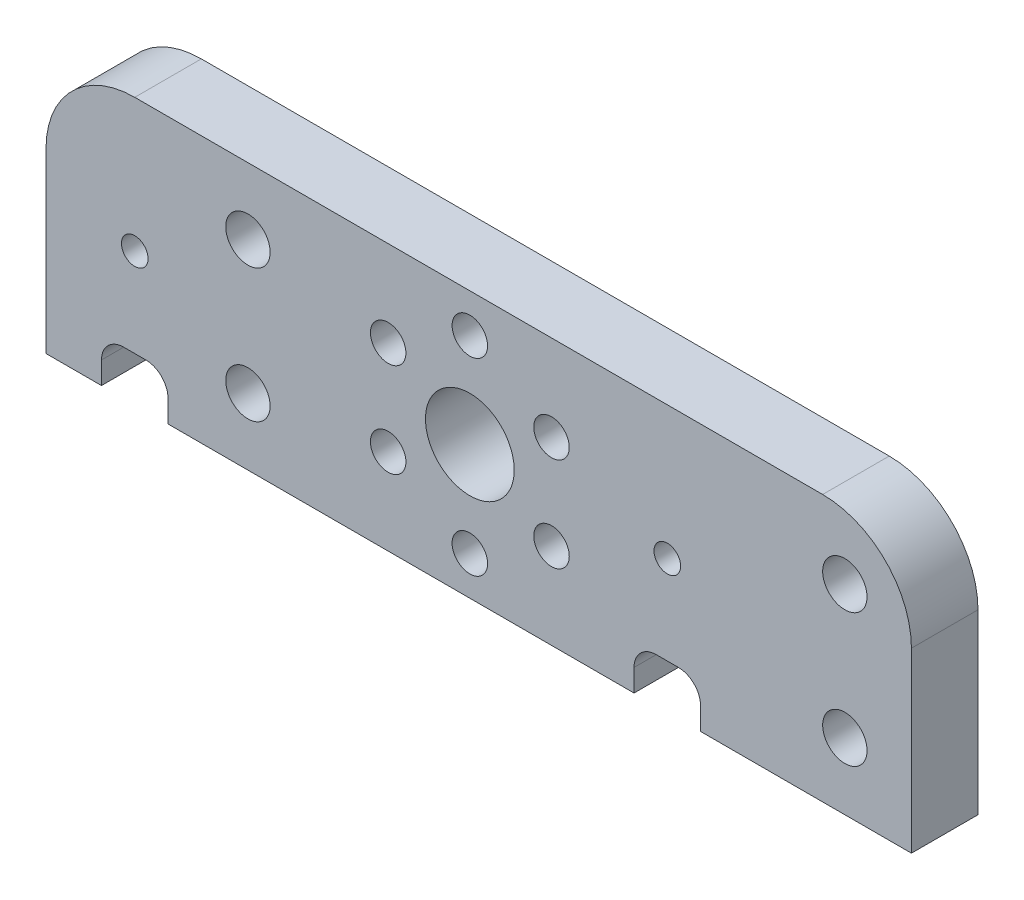
ISO-10303-21;
HEADER;
FILE_DESCRIPTION(('STEP AP214'),'2;1');
FILE_NAME('part.step','',(''),(''),'','','');
FILE_SCHEMA(('AUTOMOTIVE_DESIGN { 1 0 10303 214 1 1 1 1 }'));
ENDSEC;
DATA;
#1=APPLICATION_CONTEXT('core data for automotive mechanical design processes');
#2=APPLICATION_PROTOCOL_DEFINITION('international standard','automotive_design',2000,#1);
#3=PRODUCT_CONTEXT('',#1,'mechanical');
#4=PRODUCT('Part','Part','',(#3));
#5=PRODUCT_RELATED_PRODUCT_CATEGORY('part','',(#4));
#6=PRODUCT_DEFINITION_FORMATION('','',#4);
#7=PRODUCT_DEFINITION_CONTEXT('part definition',#1,'design');
#8=PRODUCT_DEFINITION('design','',#6,#7);
#9=PRODUCT_DEFINITION_SHAPE('','',#8);
#10=(LENGTH_UNIT() NAMED_UNIT(*) SI_UNIT(.MILLI.,.METRE.));
#11=(NAMED_UNIT(*) PLANE_ANGLE_UNIT() SI_UNIT($,.RADIAN.));
#12=(NAMED_UNIT(*) SI_UNIT($,.STERADIAN.) SOLID_ANGLE_UNIT());
#13=UNCERTAINTY_MEASURE_WITH_UNIT(LENGTH_MEASURE(1.E-05),#10,'distance_accuracy_value','');
#14=(GEOMETRIC_REPRESENTATION_CONTEXT(3) GLOBAL_UNCERTAINTY_ASSIGNED_CONTEXT((#13)) GLOBAL_UNIT_ASSIGNED_CONTEXT((#10,
#11,#12)) REPRESENTATION_CONTEXT('',''));
#15=CARTESIAN_POINT('',(0.,0.,0.));
#16=DIRECTION('',(0.,0.,1.));
#17=DIRECTION('',(1.,0.,0.));
#18=AXIS2_PLACEMENT_3D('',#15,#16,#17);
#19=CARTESIAN_POINT('',(-20.6,0.,3.));
#20=DIRECTION('',(-1.,0.,0.));
#21=DIRECTION('',(0.,0.,1.));
#22=AXIS2_PLACEMENT_3D('',#19,#20,#21);
#23=PLANE('',#22);
#24=DIRECTION('',(0.,1.,0.));
#25=VECTOR('',#24,1.);
#26=CARTESIAN_POINT('',(-20.6,0.,0.));
#27=LINE('',#26,#25);
#28=CARTESIAN_POINT('',(-20.6,-6.,0.));
#29=VERTEX_POINT('',#28);
#30=CARTESIAN_POINT('',(-20.6,-5.,0.));
#31=VERTEX_POINT('',#30);
#32=EDGE_CURVE('E215',#29,#31,#27,.T.);
#33=ORIENTED_EDGE('',*,*,#32,.T.);
#34=DIRECTION('',(0.,0.,-1.));
#35=VECTOR('',#34,1.);
#36=CARTESIAN_POINT('',(-20.6,-5.,3.));
#37=LINE('',#36,#35);
#38=CARTESIAN_POINT('',(-20.6,-5.,3.));
#39=VERTEX_POINT('',#38);
#40=EDGE_CURVE('E11',#39,#31,#37,.T.);
#41=ORIENTED_EDGE('',*,*,#40,.F.);
#42=DIRECTION('',(0.,1.,0.));
#43=VECTOR('',#42,1.);
#44=CARTESIAN_POINT('',(-20.6,0.,3.));
#45=LINE('',#44,#43);
#46=CARTESIAN_POINT('',(-20.6,-6.,3.));
#47=VERTEX_POINT('',#46);
#48=EDGE_CURVE('E668',#47,#39,#45,.T.);
#49=ORIENTED_EDGE('',*,*,#48,.F.);
#50=DIRECTION('',(0.,0.,-1.));
#51=VECTOR('',#50,1.);
#52=CARTESIAN_POINT('',(-20.6,-6.,3.));
#53=LINE('',#52,#51);
#54=EDGE_CURVE('E187',#47,#29,#53,.T.);
#55=ORIENTED_EDGE('',*,*,#54,.T.);
#56=EDGE_LOOP('',(#33,#41,#49,#55));
#57=FACE_BOUND('',#56,.T.);
#58=ADVANCED_FACE('F35',(#57),#23,.F.);
#59=CARTESIAN_POINT('',(-19.6,-5.,3.));
#60=DIRECTION('',(0.,0.,-1.));
#61=DIRECTION('',(-1.,0.,0.));
#62=AXIS2_PLACEMENT_3D('',#59,#60,#61);
#63=CYLINDRICAL_SURFACE('',#62,1.);
#64=CARTESIAN_POINT('',(-19.6,-5.,0.));
#65=DIRECTION('',(0.,0.,1.));
#66=DIRECTION('',(1.,0.,0.));
#67=AXIS2_PLACEMENT_3D('',#64,#65,#66);
#68=CIRCLE('',#67,1.);
#69=CARTESIAN_POINT('',(-19.6,-4.,0.));
#70=VERTEX_POINT('',#69);
#71=EDGE_CURVE('E218',#31,#70,#68,.F.);
#72=ORIENTED_EDGE('',*,*,#71,.T.);
#73=DIRECTION('',(0.,0.,-1.));
#74=VECTOR('',#73,1.);
#75=CARTESIAN_POINT('',(-19.6,-4.,3.));
#76=LINE('',#75,#74);
#77=CARTESIAN_POINT('',(-19.6,-4.,3.));
#78=VERTEX_POINT('',#77);
#79=EDGE_CURVE('E44',#78,#70,#76,.T.);
#80=ORIENTED_EDGE('',*,*,#79,.F.);
#81=CARTESIAN_POINT('',(-19.6,-5.,3.));
#82=DIRECTION('',(0.,0.,1.));
#83=DIRECTION('',(1.,0.,0.));
#84=AXIS2_PLACEMENT_3D('',#81,#82,#83);
#85=CIRCLE('',#84,1.);
#86=EDGE_CURVE('E121',#39,#78,#85,.F.);
#87=ORIENTED_EDGE('',*,*,#86,.F.);
#88=ORIENTED_EDGE('',*,*,#40,.T.);
#89=EDGE_LOOP('',(#72,#80,#87,#88));
#90=FACE_BOUND('',#89,.T.);
#91=ADVANCED_FACE('F389',(#90),#63,.F.);
#92=CARTESIAN_POINT('',(0.,-4.,3.));
#93=DIRECTION('',(0.,1.,0.));
#94=DIRECTION('',(0.,0.,1.));
#95=AXIS2_PLACEMENT_3D('',#92,#93,#94);
#96=PLANE('',#95);
#97=DIRECTION('',(1.,0.,0.));
#98=VECTOR('',#97,1.);
#99=CARTESIAN_POINT('',(0.,-4.,0.));
#100=LINE('',#99,#98);
#101=CARTESIAN_POINT('',(-18.6,-4.,0.));
#102=VERTEX_POINT('',#101);
#103=EDGE_CURVE('E220',#70,#102,#100,.T.);
#104=ORIENTED_EDGE('',*,*,#103,.T.);
#105=DIRECTION('',(0.,0.,-1.));
#106=VECTOR('',#105,1.);
#107=CARTESIAN_POINT('',(-18.6,-4.,3.));
#108=LINE('',#107,#106);
#109=CARTESIAN_POINT('',(-18.6,-4.,3.));
#110=VERTEX_POINT('',#109);
#111=EDGE_CURVE('E285',#110,#102,#108,.T.);
#112=ORIENTED_EDGE('',*,*,#111,.F.);
#113=DIRECTION('',(1.,0.,0.));
#114=VECTOR('',#113,1.);
#115=CARTESIAN_POINT('',(0.,-4.,3.));
#116=LINE('',#115,#114);
#117=EDGE_CURVE('E293',#78,#110,#116,.T.);
#118=ORIENTED_EDGE('',*,*,#117,.F.);
#119=ORIENTED_EDGE('',*,*,#79,.T.);
#120=EDGE_LOOP('',(#104,#112,#118,#119));
#121=FACE_BOUND('',#120,.T.);
#122=ADVANCED_FACE('F291',(#121),#96,.F.);
#123=CARTESIAN_POINT('',(-18.6,-5.,3.));
#124=DIRECTION('',(0.,0.,-1.));
#125=DIRECTION('',(-1.,0.,0.));
#126=AXIS2_PLACEMENT_3D('',#123,#124,#125);
#127=CYLINDRICAL_SURFACE('',#126,1.);
#128=CARTESIAN_POINT('',(-18.6,-5.,0.));
#129=DIRECTION('',(0.,0.,1.));
#130=DIRECTION('',(1.,0.,0.));
#131=AXIS2_PLACEMENT_3D('',#128,#129,#130);
#132=CIRCLE('',#131,1.);
#133=CARTESIAN_POINT('',(-17.6,-5.,0.));
#134=VERTEX_POINT('',#133);
#135=EDGE_CURVE('E222',#102,#134,#132,.F.);
#136=ORIENTED_EDGE('',*,*,#135,.T.);
#137=DIRECTION('',(0.,0.,-1.));
#138=VECTOR('',#137,1.);
#139=CARTESIAN_POINT('',(-17.6,-5.,3.));
#140=LINE('',#139,#138);
#141=CARTESIAN_POINT('',(-17.6,-5.,3.));
#142=VERTEX_POINT('',#141);
#143=EDGE_CURVE('E283',#142,#134,#140,.T.);
#144=ORIENTED_EDGE('',*,*,#143,.F.);
#145=CARTESIAN_POINT('',(-18.6,-5.,3.));
#146=DIRECTION('',(0.,0.,1.));
#147=DIRECTION('',(1.,0.,0.));
#148=AXIS2_PLACEMENT_3D('',#145,#146,#147);
#149=CIRCLE('',#148,1.);
#150=EDGE_CURVE('E305',#110,#142,#149,.F.);
#151=ORIENTED_EDGE('',*,*,#150,.F.);
#152=ORIENTED_EDGE('',*,*,#111,.T.);
#153=EDGE_LOOP('',(#136,#144,#151,#152));
#154=FACE_BOUND('',#153,.T.);
#155=ADVANCED_FACE('F302',(#154),#127,.F.);
#156=CARTESIAN_POINT('',(-17.6,0.,3.));
#157=DIRECTION('',(-1.,0.,0.));
#158=DIRECTION('',(0.,0.,1.));
#159=AXIS2_PLACEMENT_3D('',#156,#157,#158);
#160=PLANE('',#159);
#161=DIRECTION('',(0.,1.,0.));
#162=VECTOR('',#161,1.);
#163=CARTESIAN_POINT('',(-17.6,0.,0.));
#164=LINE('',#163,#162);
#165=CARTESIAN_POINT('',(-17.6,-6.,0.));
#166=VERTEX_POINT('',#165);
#167=EDGE_CURVE('E225',#166,#134,#164,.T.);
#168=ORIENTED_EDGE('',*,*,#167,.F.);
#169=DIRECTION('',(0.,0.,-1.));
#170=VECTOR('',#169,1.);
#171=CARTESIAN_POINT('',(-17.6,-6.,3.));
#172=LINE('',#171,#170);
#173=CARTESIAN_POINT('',(-17.6,-6.,3.));
#174=VERTEX_POINT('',#173);
#175=EDGE_CURVE('E281',#174,#166,#172,.T.);
#176=ORIENTED_EDGE('',*,*,#175,.F.);
#177=DIRECTION('',(0.,1.,0.));
#178=VECTOR('',#177,1.);
#179=CARTESIAN_POINT('',(-17.6,0.,3.));
#180=LINE('',#179,#178);
#181=EDGE_CURVE('E307',#174,#142,#180,.T.);
#182=ORIENTED_EDGE('',*,*,#181,.T.);
#183=ORIENTED_EDGE('',*,*,#143,.T.);
#184=EDGE_LOOP('',(#168,#176,#182,#183));
#185=FACE_BOUND('',#184,.T.);
#186=ADVANCED_FACE('F377',(#185),#160,.T.);
#187=CARTESIAN_POINT('',(0.,-6.,3.));
#188=DIRECTION('',(0.,1.,0.));
#189=DIRECTION('',(0.,0.,1.));
#190=AXIS2_PLACEMENT_3D('',#187,#188,#189);
#191=PLANE('',#190);
#192=DIRECTION('',(1.,0.,0.));
#193=VECTOR('',#192,1.);
#194=CARTESIAN_POINT('',(0.,-6.,0.));
#195=LINE('',#194,#193);
#196=CARTESIAN_POINT('',(3.4,-6.,0.));
#197=VERTEX_POINT('',#196);
#198=EDGE_CURVE('E228',#166,#197,#195,.T.);
#199=ORIENTED_EDGE('',*,*,#198,.T.);
#200=DIRECTION('',(0.,0.,-1.));
#201=VECTOR('',#200,1.);
#202=CARTESIAN_POINT('',(3.4,-6.,3.));
#203=LINE('',#202,#201);
#204=CARTESIAN_POINT('',(3.4,-6.,3.));
#205=VERTEX_POINT('',#204);
#206=EDGE_CURVE('E278',#205,#197,#203,.T.);
#207=ORIENTED_EDGE('',*,*,#206,.F.);
#208=DIRECTION('',(1.,0.,0.));
#209=VECTOR('',#208,1.);
#210=CARTESIAN_POINT('',(0.,-6.,3.));
#211=LINE('',#210,#209);
#212=EDGE_CURVE('E190',#174,#205,#211,.T.);
#213=ORIENTED_EDGE('',*,*,#212,.F.);
#214=ORIENTED_EDGE('',*,*,#175,.T.);
#215=EDGE_LOOP('',(#199,#207,#213,#214));
#216=FACE_BOUND('',#215,.T.);
#217=ADVANCED_FACE('F375',(#216),#191,.F.);
#218=CARTESIAN_POINT('',(3.4,0.,3.));
#219=DIRECTION('',(-1.,0.,0.));
#220=DIRECTION('',(0.,-1.,0.));
#221=AXIS2_PLACEMENT_3D('',#218,#219,#220);
#222=PLANE('',#221);
#223=DIRECTION('',(0.,1.,0.));
#224=VECTOR('',#223,1.);
#225=CARTESIAN_POINT('',(3.4,0.,0.));
#226=LINE('',#225,#224);
#227=CARTESIAN_POINT('',(3.4,-5.,0.));
#228=VERTEX_POINT('',#227);
#229=EDGE_CURVE('E230',#197,#228,#226,.T.);
#230=ORIENTED_EDGE('',*,*,#229,.T.);
#231=DIRECTION('',(0.,0.,-1.));
#232=VECTOR('',#231,1.);
#233=CARTESIAN_POINT('',(3.4,-5.,3.));
#234=LINE('',#233,#232);
#235=CARTESIAN_POINT('',(3.4,-5.,3.));
#236=VERTEX_POINT('',#235);
#237=EDGE_CURVE('E275',#236,#228,#234,.T.);
#238=ORIENTED_EDGE('',*,*,#237,.F.);
#239=DIRECTION('',(0.,1.,0.));
#240=VECTOR('',#239,1.);
#241=CARTESIAN_POINT('',(3.4,0.,3.));
#242=LINE('',#241,#240);
#243=EDGE_CURVE('E313',#205,#236,#242,.T.);
#244=ORIENTED_EDGE('',*,*,#243,.F.);
#245=ORIENTED_EDGE('',*,*,#206,.T.);
#246=EDGE_LOOP('',(#230,#238,#244,#245));
#247=FACE_BOUND('',#246,.T.);
#248=ADVANCED_FACE('F370',(#247),#222,.F.);
#249=CARTESIAN_POINT('',(4.4,-5.,3.));
#250=DIRECTION('',(0.,0.,-1.));
#251=DIRECTION('',(-1.,0.,0.));
#252=AXIS2_PLACEMENT_3D('',#249,#250,#251);
#253=CYLINDRICAL_SURFACE('',#252,0.999999999999999);
#254=CARTESIAN_POINT('',(4.4,-5.,0.));
#255=DIRECTION('',(0.,0.,1.));
#256=DIRECTION('',(1.,0.,0.));
#257=AXIS2_PLACEMENT_3D('',#254,#255,#256);
#258=CIRCLE('',#257,0.999999999999999);
#259=CARTESIAN_POINT('',(4.4,-4.,0.));
#260=VERTEX_POINT('',#259);
#261=EDGE_CURVE('E233',#228,#260,#258,.F.);
#262=ORIENTED_EDGE('',*,*,#261,.T.);
#263=DIRECTION('',(0.,0.,-1.));
#264=VECTOR('',#263,1.);
#265=CARTESIAN_POINT('',(4.4,-4.,3.));
#266=LINE('',#265,#264);
#267=CARTESIAN_POINT('',(4.4,-4.,3.));
#268=VERTEX_POINT('',#267);
#269=EDGE_CURVE('E272',#268,#260,#266,.T.);
#270=ORIENTED_EDGE('',*,*,#269,.F.);
#271=CARTESIAN_POINT('',(4.4,-5.,3.));
#272=DIRECTION('',(0.,0.,1.));
#273=DIRECTION('',(1.,0.,0.));
#274=AXIS2_PLACEMENT_3D('',#271,#272,#273);
#275=CIRCLE('',#274,0.999999999999999);
#276=EDGE_CURVE('E315',#236,#268,#275,.F.);
#277=ORIENTED_EDGE('',*,*,#276,.F.);
#278=ORIENTED_EDGE('',*,*,#237,.T.);
#279=EDGE_LOOP('',(#262,#270,#277,#278));
#280=FACE_BOUND('',#279,.T.);
#281=ADVANCED_FACE('F366',(#280),#253,.F.);
#282=CARTESIAN_POINT('',(0.,-4.,3.));
#283=DIRECTION('',(0.,1.,0.));
#284=DIRECTION('',(0.,0.,1.));
#285=AXIS2_PLACEMENT_3D('',#282,#283,#284);
#286=PLANE('',#285);
#287=DIRECTION('',(1.,0.,0.));
#288=VECTOR('',#287,1.);
#289=CARTESIAN_POINT('',(0.,-4.,0.));
#290=LINE('',#289,#288);
#291=CARTESIAN_POINT('',(5.4,-4.,0.));
#292=VERTEX_POINT('',#291);
#293=EDGE_CURVE('E235',#260,#292,#290,.T.);
#294=ORIENTED_EDGE('',*,*,#293,.T.);
#295=DIRECTION('',(0.,0.,-1.));
#296=VECTOR('',#295,1.);
#297=CARTESIAN_POINT('',(5.4,-4.,3.));
#298=LINE('',#297,#296);
#299=CARTESIAN_POINT('',(5.4,-4.,3.));
#300=VERTEX_POINT('',#299);
#301=EDGE_CURVE('E269',#300,#292,#298,.T.);
#302=ORIENTED_EDGE('',*,*,#301,.F.);
#303=DIRECTION('',(1.,0.,0.));
#304=VECTOR('',#303,1.);
#305=CARTESIAN_POINT('',(0.,-4.,3.));
#306=LINE('',#305,#304);
#307=EDGE_CURVE('E317',#268,#300,#306,.T.);
#308=ORIENTED_EDGE('',*,*,#307,.F.);
#309=ORIENTED_EDGE('',*,*,#269,.T.);
#310=EDGE_LOOP('',(#294,#302,#308,#309));
#311=FACE_BOUND('',#310,.T.);
#312=ADVANCED_FACE('F362',(#311),#286,.F.);
#313=CARTESIAN_POINT('',(5.4,-5.,3.));
#314=DIRECTION('',(0.,0.,-1.));
#315=DIRECTION('',(-1.,0.,0.));
#316=AXIS2_PLACEMENT_3D('',#313,#314,#315);
#317=CYLINDRICAL_SURFACE('',#316,0.999999999999999);
#318=CARTESIAN_POINT('',(5.4,-5.,0.));
#319=DIRECTION('',(0.,0.,1.));
#320=DIRECTION('',(1.,0.,0.));
#321=AXIS2_PLACEMENT_3D('',#318,#319,#320);
#322=CIRCLE('',#321,0.999999999999999);
#323=CARTESIAN_POINT('',(6.4,-5.,0.));
#324=VERTEX_POINT('',#323);
#325=EDGE_CURVE('E237',#292,#324,#322,.F.);
#326=ORIENTED_EDGE('',*,*,#325,.T.);
#327=DIRECTION('',(0.,0.,-1.));
#328=VECTOR('',#327,1.);
#329=CARTESIAN_POINT('',(6.4,-5.,3.));
#330=LINE('',#329,#328);
#331=CARTESIAN_POINT('',(6.4,-5.,3.));
#332=VERTEX_POINT('',#331);
#333=EDGE_CURVE('E267',#332,#324,#330,.T.);
#334=ORIENTED_EDGE('',*,*,#333,.F.);
#335=CARTESIAN_POINT('',(5.4,-5.,3.));
#336=DIRECTION('',(0.,0.,1.));
#337=DIRECTION('',(1.,0.,0.));
#338=AXIS2_PLACEMENT_3D('',#335,#336,#337);
#339=CIRCLE('',#338,0.999999999999999);
#340=EDGE_CURVE('E319',#300,#332,#339,.F.);
#341=ORIENTED_EDGE('',*,*,#340,.F.);
#342=ORIENTED_EDGE('',*,*,#301,.T.);
#343=EDGE_LOOP('',(#326,#334,#341,#342));
#344=FACE_BOUND('',#343,.T.);
#345=ADVANCED_FACE('F358',(#344),#317,.F.);
#346=CARTESIAN_POINT('',(6.4,0.,3.));
#347=DIRECTION('',(-1.,0.,0.));
#348=DIRECTION('',(0.,0.,1.));
#349=AXIS2_PLACEMENT_3D('',#346,#347,#348);
#350=PLANE('',#349);
#351=DIRECTION('',(0.,1.,0.));
#352=VECTOR('',#351,1.);
#353=CARTESIAN_POINT('',(6.4,0.,0.));
#354=LINE('',#353,#352);
#355=CARTESIAN_POINT('',(6.4,-6.,0.));
#356=VERTEX_POINT('',#355);
#357=EDGE_CURVE('E240',#356,#324,#354,.T.);
#358=ORIENTED_EDGE('',*,*,#357,.F.);
#359=DIRECTION('',(0.,0.,-1.));
#360=VECTOR('',#359,1.);
#361=CARTESIAN_POINT('',(6.4,-6.,3.));
#362=LINE('',#361,#360);
#363=CARTESIAN_POINT('',(6.4,-6.,3.));
#364=VERTEX_POINT('',#363);
#365=EDGE_CURVE('E265',#364,#356,#362,.T.);
#366=ORIENTED_EDGE('',*,*,#365,.F.);
#367=DIRECTION('',(0.,1.,0.));
#368=VECTOR('',#367,1.);
#369=CARTESIAN_POINT('',(6.4,0.,3.));
#370=LINE('',#369,#368);
#371=EDGE_CURVE('E321',#364,#332,#370,.T.);
#372=ORIENTED_EDGE('',*,*,#371,.T.);
#373=ORIENTED_EDGE('',*,*,#333,.T.);
#374=EDGE_LOOP('',(#358,#366,#372,#373));
#375=FACE_BOUND('',#374,.T.);
#376=ADVANCED_FACE('F353',(#375),#350,.T.);
#377=CARTESIAN_POINT('',(15.9,-6.,0.));
#378=VERTEX_POINT('',#377);
#379=EDGE_CURVE('E231',#356,#378,#195,.T.);
#380=ORIENTED_EDGE('',*,*,#379,.T.);
#381=DIRECTION('',(0.,0.,-1.));
#382=VECTOR('',#381,1.);
#383=CARTESIAN_POINT('',(15.9,-6.,3.));
#384=LINE('',#383,#382);
#385=CARTESIAN_POINT('',(15.9,-6.,3.));
#386=VERTEX_POINT('',#385);
#387=EDGE_CURVE('E262',#386,#378,#384,.T.);
#388=ORIENTED_EDGE('',*,*,#387,.F.);
#389=EDGE_CURVE('E189',#364,#386,#211,.T.);
#390=ORIENTED_EDGE('',*,*,#389,.F.);
#391=ORIENTED_EDGE('',*,*,#365,.T.);
#392=EDGE_LOOP('',(#380,#388,#390,#391));
#393=FACE_BOUND('',#392,.T.);
#394=ADVANCED_FACE('F339',(#393),#191,.F.);
#395=CARTESIAN_POINT('',(15.9,0.,3.));
#396=DIRECTION('',(-1.,0.,0.));
#397=DIRECTION('',(0.,-1.,0.));
#398=AXIS2_PLACEMENT_3D('',#395,#396,#397);
#399=PLANE('',#398);
#400=DIRECTION('',(0.,1.,0.));
#401=VECTOR('',#400,1.);
#402=CARTESIAN_POINT('',(15.9,0.,0.));
#403=LINE('',#402,#401);
#404=CARTESIAN_POINT('',(15.9,2.,0.));
#405=VERTEX_POINT('',#404);
#406=EDGE_CURVE('E243',#378,#405,#403,.T.);
#407=ORIENTED_EDGE('',*,*,#406,.T.);
#408=DIRECTION('',(0.,0.,-1.));
#409=VECTOR('',#408,1.);
#410=CARTESIAN_POINT('',(15.9,2.,3.));
#411=LINE('',#410,#409);
#412=CARTESIAN_POINT('',(15.9,2.,3.));
#413=VERTEX_POINT('',#412);
#414=EDGE_CURVE('E260',#413,#405,#411,.T.);
#415=ORIENTED_EDGE('',*,*,#414,.F.);
#416=DIRECTION('',(0.,1.,0.));
#417=VECTOR('',#416,1.);
#418=CARTESIAN_POINT('',(15.9,0.,3.));
#419=LINE('',#418,#417);
#420=EDGE_CURVE('E324',#386,#413,#419,.T.);
#421=ORIENTED_EDGE('',*,*,#420,.F.);
#422=ORIENTED_EDGE('',*,*,#387,.T.);
#423=EDGE_LOOP('',(#407,#415,#421,#422));
#424=FACE_BOUND('',#423,.T.);
#425=ADVANCED_FACE('F345',(#424),#399,.F.);
#426=CARTESIAN_POINT('',(11.9,2.,3.));
#427=DIRECTION('',(0.,0.,-1.));
#428=DIRECTION('',(-1.,0.,0.));
#429=AXIS2_PLACEMENT_3D('',#426,#427,#428);
#430=CYLINDRICAL_SURFACE('',#429,4.);
#431=CARTESIAN_POINT('',(11.9,2.,0.));
#432=DIRECTION('',(0.,0.,1.));
#433=DIRECTION('',(1.,0.,0.));
#434=AXIS2_PLACEMENT_3D('',#431,#432,#433);
#435=CIRCLE('',#434,4.);
#436=CARTESIAN_POINT('',(11.9,6.,0.));
#437=VERTEX_POINT('',#436);
#438=EDGE_CURVE('E246',#437,#405,#435,.F.);
#439=ORIENTED_EDGE('',*,*,#438,.F.);
#440=DIRECTION('',(0.,0.,-1.));
#441=VECTOR('',#440,1.);
#442=CARTESIAN_POINT('',(11.9,6.,3.));
#443=LINE('',#442,#441);
#444=CARTESIAN_POINT('',(11.9,6.,3.));
#445=VERTEX_POINT('',#444);
#446=EDGE_CURVE('E258',#445,#437,#443,.T.);
#447=ORIENTED_EDGE('',*,*,#446,.F.);
#448=CARTESIAN_POINT('',(11.9,2.,3.));
#449=DIRECTION('',(0.,0.,1.));
#450=DIRECTION('',(1.,0.,0.));
#451=AXIS2_PLACEMENT_3D('',#448,#449,#450);
#452=CIRCLE('',#451,4.);
#453=EDGE_CURVE('E326',#445,#413,#452,.F.);
#454=ORIENTED_EDGE('',*,*,#453,.T.);
#455=ORIENTED_EDGE('',*,*,#414,.T.);
#456=EDGE_LOOP('',(#439,#447,#454,#455));
#457=FACE_BOUND('',#456,.T.);
#458=ADVANCED_FACE('F348',(#457),#430,.T.);
#459=CARTESIAN_POINT('',(0.,6.,3.));
#460=DIRECTION('',(0.,1.,0.));
#461=DIRECTION('',(0.,0.,1.));
#462=AXIS2_PLACEMENT_3D('',#459,#460,#461);
#463=PLANE('',#462);
#464=DIRECTION('',(1.,0.,0.));
#465=VECTOR('',#464,1.);
#466=CARTESIAN_POINT('',(0.,6.,0.));
#467=LINE('',#466,#465);
#468=CARTESIAN_POINT('',(-19.1,6.,0.));
#469=VERTEX_POINT('',#468);
#470=EDGE_CURVE('E249',#469,#437,#467,.T.);
#471=ORIENTED_EDGE('',*,*,#470,.F.);
#472=DIRECTION('',(0.,0.,-1.));
#473=VECTOR('',#472,1.);
#474=CARTESIAN_POINT('',(-19.1,6.,3.));
#475=LINE('',#474,#473);
#476=CARTESIAN_POINT('',(-19.1,6.,3.));
#477=VERTEX_POINT('',#476);
#478=EDGE_CURVE('E176',#477,#469,#475,.T.);
#479=ORIENTED_EDGE('',*,*,#478,.F.);
#480=DIRECTION('',(1.,0.,0.));
#481=VECTOR('',#480,1.);
#482=CARTESIAN_POINT('',(0.,6.,3.));
#483=LINE('',#482,#481);
#484=EDGE_CURVE('E183',#477,#445,#483,.T.);
#485=ORIENTED_EDGE('',*,*,#484,.T.);
#486=ORIENTED_EDGE('',*,*,#446,.T.);
#487=EDGE_LOOP('',(#471,#479,#485,#486));
#488=FACE_BOUND('',#487,.T.);
#489=ADVANCED_FACE('F330',(#488),#463,.T.);
#490=CARTESIAN_POINT('',(-19.1,2.,3.));
#491=DIRECTION('',(0.,0.,-1.));
#492=DIRECTION('',(-1.,0.,0.));
#493=AXIS2_PLACEMENT_3D('',#490,#491,#492);
#494=CYLINDRICAL_SURFACE('',#493,4.);
#495=CARTESIAN_POINT('',(-19.1,2.,0.));
#496=DIRECTION('',(0.,0.,1.));
#497=DIRECTION('',(1.,0.,0.));
#498=AXIS2_PLACEMENT_3D('',#495,#496,#497);
#499=CIRCLE('',#498,4.);
#500=CARTESIAN_POINT('',(-23.1,2.,0.));
#501=VERTEX_POINT('',#500);
#502=EDGE_CURVE('E171',#501,#469,#499,.F.);
#503=ORIENTED_EDGE('',*,*,#502,.F.);
#504=DIRECTION('',(0.,0.,-1.));
#505=VECTOR('',#504,1.);
#506=CARTESIAN_POINT('',(-23.1,2.,3.));
#507=LINE('',#506,#505);
#508=CARTESIAN_POINT('',(-23.1,2.,3.));
#509=VERTEX_POINT('',#508);
#510=EDGE_CURVE('E166',#509,#501,#507,.T.);
#511=ORIENTED_EDGE('',*,*,#510,.F.);
#512=CARTESIAN_POINT('',(-19.1,2.,3.));
#513=DIRECTION('',(0.,0.,1.));
#514=DIRECTION('',(1.,0.,0.));
#515=AXIS2_PLACEMENT_3D('',#512,#513,#514);
#516=CIRCLE('',#515,4.);
#517=EDGE_CURVE('E169',#509,#477,#516,.F.);
#518=ORIENTED_EDGE('',*,*,#517,.T.);
#519=ORIENTED_EDGE('',*,*,#478,.T.);
#520=EDGE_LOOP('',(#503,#511,#518,#519));
#521=FACE_BOUND('',#520,.T.);
#522=ADVANCED_FACE('F168',(#521),#494,.T.);
#523=CARTESIAN_POINT('',(-23.1,0.,3.));
#524=DIRECTION('',(-1.,0.,0.));
#525=DIRECTION('',(0.,0.,1.));
#526=AXIS2_PLACEMENT_3D('',#523,#524,#525);
#527=PLANE('',#526);
#528=DIRECTION('',(0.,1.,0.));
#529=VECTOR('',#528,1.);
#530=CARTESIAN_POINT('',(-23.1,0.,0.));
#531=LINE('',#530,#529);
#532=CARTESIAN_POINT('',(-23.1,-6.,0.));
#533=VERTEX_POINT('',#532);
#534=EDGE_CURVE('E253',#533,#501,#531,.T.);
#535=ORIENTED_EDGE('',*,*,#534,.F.);
#536=DIRECTION('',(0.,0.,-1.));
#537=VECTOR('',#536,1.);
#538=CARTESIAN_POINT('',(-23.1,-6.,3.));
#539=LINE('',#538,#537);
#540=CARTESIAN_POINT('',(-23.1,-6.,3.));
#541=VERTEX_POINT('',#540);
#542=EDGE_CURVE('E110',#541,#533,#539,.T.);
#543=ORIENTED_EDGE('',*,*,#542,.F.);
#544=DIRECTION('',(0.,1.,0.));
#545=VECTOR('',#544,1.);
#546=CARTESIAN_POINT('',(-23.1,0.,3.));
#547=LINE('',#546,#545);
#548=EDGE_CURVE('E180',#541,#509,#547,.T.);
#549=ORIENTED_EDGE('',*,*,#548,.T.);
#550=ORIENTED_EDGE('',*,*,#510,.T.);
#551=EDGE_LOOP('',(#535,#543,#549,#550));
#552=FACE_BOUND('',#551,.T.);
#553=ADVANCED_FACE('F185',(#552),#527,.T.);
#554=CARTESIAN_POINT('',(-4.,0.,3.));
#555=DIRECTION('',(0.,0.,-1.));
#556=DIRECTION('',(-1.,0.,0.));
#557=AXIS2_PLACEMENT_3D('',#554,#555,#556);
#558=CYLINDRICAL_SURFACE('',#557,2.);
#559=CARTESIAN_POINT('',(-4.,0.,3.));
#560=DIRECTION('',(0.,0.,1.));
#561=DIRECTION('',(1.,0.,0.));
#562=AXIS2_PLACEMENT_3D('',#559,#560,#561);
#563=CIRCLE('',#562,2.);
#564=CARTESIAN_POINT('',(-2.,0.,3.));
#565=VERTEX_POINT('',#564);
#566=EDGE_CURVE('E665',#565,#565,#563,.T.);
#567=ORIENTED_EDGE('',*,*,#566,.T.);
#568=EDGE_LOOP('',(#567));
#569=FACE_BOUND('',#568,.T.);
#570=CARTESIAN_POINT('',(-4.,0.,0.));
#571=DIRECTION('',(0.,0.,1.));
#572=DIRECTION('',(1.,0.,0.));
#573=AXIS2_PLACEMENT_3D('',#570,#571,#572);
#574=CIRCLE('',#573,2.);
#575=CARTESIAN_POINT('',(-2.,0.,0.));
#576=VERTEX_POINT('',#575);
#577=EDGE_CURVE('E212',#576,#576,#574,.T.);
#578=ORIENTED_EDGE('',*,*,#577,.F.);
#579=EDGE_LOOP('',(#578));
#580=FACE_BOUND('',#579,.T.);
#581=ADVANCED_FACE('F398',(#569,#580),#558,.F.);
#582=CARTESIAN_POINT('',(4.9,0.,3.));
#583=DIRECTION('',(0.,0.,-1.));
#584=DIRECTION('',(-1.,0.,0.));
#585=AXIS2_PLACEMENT_3D('',#582,#583,#584);
#586=CYLINDRICAL_SURFACE('',#585,0.6);
#587=CARTESIAN_POINT('',(4.9,0.,3.));
#588=DIRECTION('',(0.,0.,1.));
#589=DIRECTION('',(1.,0.,0.));
#590=AXIS2_PLACEMENT_3D('',#587,#588,#589);
#591=CIRCLE('',#590,0.6);
#592=CARTESIAN_POINT('',(5.5,0.,3.));
#593=VERTEX_POINT('',#592);
#594=EDGE_CURVE('E662',#593,#593,#591,.T.);
#595=ORIENTED_EDGE('',*,*,#594,.T.);
#596=EDGE_LOOP('',(#595));
#597=FACE_BOUND('',#596,.T.);
#598=CARTESIAN_POINT('',(4.9,0.,0.));
#599=DIRECTION('',(0.,0.,1.));
#600=DIRECTION('',(1.,0.,0.));
#601=AXIS2_PLACEMENT_3D('',#598,#599,#600);
#602=CIRCLE('',#601,0.6);
#603=CARTESIAN_POINT('',(5.5,0.,0.));
#604=VERTEX_POINT('',#603);
#605=EDGE_CURVE('E209',#604,#604,#602,.T.);
#606=ORIENTED_EDGE('',*,*,#605,.F.);
#607=EDGE_LOOP('',(#606));
#608=FACE_BOUND('',#607,.T.);
#609=ADVANCED_FACE('F401',(#597,#608),#586,.F.);
#610=CARTESIAN_POINT('',(-19.1,0.,3.));
#611=DIRECTION('',(0.,0.,-1.));
#612=DIRECTION('',(-1.,0.,0.));
#613=AXIS2_PLACEMENT_3D('',#610,#611,#612);
#614=CYLINDRICAL_SURFACE('',#613,0.6);
#615=CARTESIAN_POINT('',(-19.1,0.,3.));
#616=DIRECTION('',(0.,0.,1.));
#617=DIRECTION('',(1.,0.,0.));
#618=AXIS2_PLACEMENT_3D('',#615,#616,#617);
#619=CIRCLE('',#618,0.6);
#620=CARTESIAN_POINT('',(-18.5,0.,3.));
#621=VERTEX_POINT('',#620);
#622=EDGE_CURVE('E659',#621,#621,#619,.T.);
#623=ORIENTED_EDGE('',*,*,#622,.T.);
#624=EDGE_LOOP('',(#623));
#625=FACE_BOUND('',#624,.T.);
#626=CARTESIAN_POINT('',(-19.1,0.,0.));
#627=DIRECTION('',(0.,0.,1.));
#628=DIRECTION('',(1.,0.,0.));
#629=AXIS2_PLACEMENT_3D('',#626,#627,#628);
#630=CIRCLE('',#629,0.6);
#631=CARTESIAN_POINT('',(-18.5,0.,0.));
#632=VERTEX_POINT('',#631);
#633=EDGE_CURVE('E206',#632,#632,#630,.T.);
#634=ORIENTED_EDGE('',*,*,#633,.F.);
#635=EDGE_LOOP('',(#634));
#636=FACE_BOUND('',#635,.T.);
#637=ADVANCED_FACE('F405',(#625,#636),#614,.F.);
#638=CARTESIAN_POINT('',(12.9,3.,3.));
#639=DIRECTION('',(0.,0.,-1.));
#640=DIRECTION('',(-1.,0.,0.));
#641=AXIS2_PLACEMENT_3D('',#638,#639,#640);
#642=CYLINDRICAL_SURFACE('',#641,1.);
#643=CARTESIAN_POINT('',(12.9,3.,3.));
#644=DIRECTION('',(0.,0.,1.));
#645=DIRECTION('',(1.,0.,0.));
#646=AXIS2_PLACEMENT_3D('',#643,#644,#645);
#647=CIRCLE('',#646,1.);
#648=CARTESIAN_POINT('',(13.9,3.,3.));
#649=VERTEX_POINT('',#648);
#650=EDGE_CURVE('E656',#649,#649,#647,.T.);
#651=ORIENTED_EDGE('',*,*,#650,.T.);
#652=EDGE_LOOP('',(#651));
#653=FACE_BOUND('',#652,.T.);
#654=CARTESIAN_POINT('',(12.9,3.,0.));
#655=DIRECTION('',(0.,0.,1.));
#656=DIRECTION('',(1.,0.,0.));
#657=AXIS2_PLACEMENT_3D('',#654,#655,#656);
#658=CIRCLE('',#657,1.);
#659=CARTESIAN_POINT('',(13.9,3.,0.));
#660=VERTEX_POINT('',#659);
#661=EDGE_CURVE('E203',#660,#660,#658,.T.);
#662=ORIENTED_EDGE('',*,*,#661,.F.);
#663=EDGE_LOOP('',(#662));
#664=FACE_BOUND('',#663,.T.);
#665=ADVANCED_FACE('F409',(#653,#664),#642,.F.);
#666=CARTESIAN_POINT('',(12.9,-3.,3.));
#667=DIRECTION('',(0.,0.,-1.));
#668=DIRECTION('',(-1.,0.,0.));
#669=AXIS2_PLACEMENT_3D('',#666,#667,#668);
#670=CYLINDRICAL_SURFACE('',#669,1.);
#671=CARTESIAN_POINT('',(12.9,-3.,3.));
#672=DIRECTION('',(0.,0.,1.));
#673=DIRECTION('',(1.,0.,0.));
#674=AXIS2_PLACEMENT_3D('',#671,#672,#673);
#675=CIRCLE('',#674,1.);
#676=CARTESIAN_POINT('',(13.9,-3.,3.));
#677=VERTEX_POINT('',#676);
#678=EDGE_CURVE('E653',#677,#677,#675,.T.);
#679=ORIENTED_EDGE('',*,*,#678,.T.);
#680=EDGE_LOOP('',(#679));
#681=FACE_BOUND('',#680,.T.);
#682=CARTESIAN_POINT('',(12.9,-3.,0.));
#683=DIRECTION('',(0.,0.,1.));
#684=DIRECTION('',(1.,0.,0.));
#685=AXIS2_PLACEMENT_3D('',#682,#683,#684);
#686=CIRCLE('',#685,1.);
#687=CARTESIAN_POINT('',(13.9,-3.,0.));
#688=VERTEX_POINT('',#687);
#689=EDGE_CURVE('E200',#688,#688,#686,.T.);
#690=ORIENTED_EDGE('',*,*,#689,.F.);
#691=EDGE_LOOP('',(#690));
#692=FACE_BOUND('',#691,.T.);
#693=ADVANCED_FACE('F413',(#681,#692),#670,.F.);
#694=CARTESIAN_POINT('',(-14.,-3.,3.));
#695=DIRECTION('',(0.,0.,-1.));
#696=DIRECTION('',(-1.,0.,0.));
#697=AXIS2_PLACEMENT_3D('',#694,#695,#696);
#698=CYLINDRICAL_SURFACE('',#697,1.);
#699=CARTESIAN_POINT('',(-14.,-3.,3.));
#700=DIRECTION('',(0.,0.,1.));
#701=DIRECTION('',(1.,0.,0.));
#702=AXIS2_PLACEMENT_3D('',#699,#700,#701);
#703=CIRCLE('',#702,1.);
#704=CARTESIAN_POINT('',(-13.,-3.,3.));
#705=VERTEX_POINT('',#704);
#706=EDGE_CURVE('E334',#705,#705,#703,.T.);
#707=ORIENTED_EDGE('',*,*,#706,.T.);
#708=EDGE_LOOP('',(#707));
#709=FACE_BOUND('',#708,.T.);
#710=CARTESIAN_POINT('',(-14.,-3.,0.));
#711=DIRECTION('',(0.,0.,1.));
#712=DIRECTION('',(1.,0.,0.));
#713=AXIS2_PLACEMENT_3D('',#710,#711,#712);
#714=CIRCLE('',#713,1.);
#715=CARTESIAN_POINT('',(-13.,-3.,0.));
#716=VERTEX_POINT('',#715);
#717=EDGE_CURVE('E196',#716,#716,#714,.T.);
#718=ORIENTED_EDGE('',*,*,#717,.F.);
#719=EDGE_LOOP('',(#718));
#720=FACE_BOUND('',#719,.T.);
#721=ADVANCED_FACE('F416',(#709,#720),#698,.F.);
#722=CARTESIAN_POINT('',(-14.,3.,3.));
#723=DIRECTION('',(0.,0.,-1.));
#724=DIRECTION('',(-1.,0.,0.));
#725=AXIS2_PLACEMENT_3D('',#722,#723,#724);
#726=CYLINDRICAL_SURFACE('',#725,1.);
#727=CARTESIAN_POINT('',(-14.,3.,3.));
#728=DIRECTION('',(0.,0.,1.));
#729=DIRECTION('',(1.,0.,0.));
#730=AXIS2_PLACEMENT_3D('',#727,#728,#729);
#731=CIRCLE('',#730,1.);
#732=CARTESIAN_POINT('',(-13.,3.,3.));
#733=VERTEX_POINT('',#732);
#734=EDGE_CURVE('E332',#733,#733,#731,.T.);
#735=ORIENTED_EDGE('',*,*,#734,.T.);
#736=EDGE_LOOP('',(#735));
#737=FACE_BOUND('',#736,.T.);
#738=CARTESIAN_POINT('',(-14.,3.,0.));
#739=DIRECTION('',(0.,0.,1.));
#740=DIRECTION('',(1.,0.,0.));
#741=AXIS2_PLACEMENT_3D('',#738,#739,#740);
#742=CIRCLE('',#741,1.);
#743=CARTESIAN_POINT('',(-13.,3.,0.));
#744=VERTEX_POINT('',#743);
#745=EDGE_CURVE('E193',#744,#744,#742,.T.);
#746=ORIENTED_EDGE('',*,*,#745,.F.);
#747=EDGE_LOOP('',(#746));
#748=FACE_BOUND('',#747,.T.);
#749=ADVANCED_FACE('F37',(#737,#748),#726,.F.);
#750=EDGE_CURVE('E113',#533,#29,#195,.T.);
#751=ORIENTED_EDGE('',*,*,#750,.T.);
#752=ORIENTED_EDGE('',*,*,#54,.F.);
#753=EDGE_CURVE('E52',#541,#47,#211,.T.);
#754=ORIENTED_EDGE('',*,*,#753,.F.);
#755=ORIENTED_EDGE('',*,*,#542,.T.);
#756=EDGE_LOOP('',(#751,#752,#754,#755));
#757=FACE_BOUND('',#756,.T.);
#758=ADVANCED_FACE('F385',(#757),#191,.F.);
#759=CARTESIAN_POINT('',(0.,0.,3.));
#760=DIRECTION('',(0.,0.,1.));
#761=DIRECTION('',(1.,0.,0.));
#762=AXIS2_PLACEMENT_3D('',#759,#760,#761);
#763=PLANE('',#762);
#764=CARTESIAN_POINT('',(-0.31939203391616,2.12500000000004,3.));
#765=DIRECTION('',(0.,0.,1.));
#766=DIRECTION('',(0.50000000000001,-0.866025403784433,0.));
#767=AXIS2_PLACEMENT_3D('',#764,#765,#766);
#768=CIRCLE('',#767,0.8);
#769=CARTESIAN_POINT('',(0.0806079660838479,1.4321796769725,3.));
#770=VERTEX_POINT('',#769);
#771=EDGE_CURVE('E634',#770,#770,#768,.T.);
#772=ORIENTED_EDGE('',*,*,#771,.F.);
#773=EDGE_LOOP('',(#772));
#774=FACE_BOUND('',#773,.T.);
#775=CARTESIAN_POINT('',(-0.319392033916116,-2.12499999999997,3.));
#776=DIRECTION('',(0.,0.,1.));
#777=DIRECTION('',(-0.499999999999992,-0.866025403784443,0.));
#778=AXIS2_PLACEMENT_3D('',#775,#776,#777);
#779=CIRCLE('',#778,0.8);
#780=CARTESIAN_POINT('',(-0.719392033916109,-2.81782032302752,3.));
#781=VERTEX_POINT('',#780);
#782=EDGE_CURVE('E636',#781,#781,#779,.T.);
#783=ORIENTED_EDGE('',*,*,#782,.F.);
#784=EDGE_LOOP('',(#783));
#785=FACE_BOUND('',#784,.T.);
#786=CARTESIAN_POINT('',(-4.,-4.25,3.));
#787=DIRECTION('',(0.,0.,1.));
#788=DIRECTION('',(-1.,0.,0.));
#789=AXIS2_PLACEMENT_3D('',#786,#787,#788);
#790=CIRCLE('',#789,0.8);
#791=CARTESIAN_POINT('',(-4.8,-4.25,3.));
#792=VERTEX_POINT('',#791);
#793=EDGE_CURVE('E705',#792,#792,#790,.T.);
#794=ORIENTED_EDGE('',*,*,#793,.F.);
#795=EDGE_LOOP('',(#794));
#796=FACE_BOUND('',#795,.T.);
#797=CARTESIAN_POINT('',(-7.68060796608386,-2.12500000000002,3.));
#798=DIRECTION('',(0.,0.,1.));
#799=DIRECTION('',(-0.500000000000004,0.866025403784436,0.));
#800=AXIS2_PLACEMENT_3D('',#797,#798,#799);
#801=CIRCLE('',#800,0.8);
#802=CARTESIAN_POINT('',(-8.08060796608386,-1.43217967697247,3.));
#803=VERTEX_POINT('',#802);
#804=EDGE_CURVE('E695',#803,#803,#801,.T.);
#805=ORIENTED_EDGE('',*,*,#804,.F.);
#806=EDGE_LOOP('',(#805));
#807=FACE_BOUND('',#806,.T.);
#808=CARTESIAN_POINT('',(-7.68060796608387,2.12499999999999,3.));
#809=DIRECTION('',(0.,0.,1.));
#810=DIRECTION('',(0.499999999999998,0.86602540378444,0.));
#811=AXIS2_PLACEMENT_3D('',#808,#809,#810);
#812=CIRCLE('',#811,0.8);
#813=CARTESIAN_POINT('',(-7.28060796608387,2.81782032302754,3.));
#814=VERTEX_POINT('',#813);
#815=EDGE_CURVE('E644',#814,#814,#812,.T.);
#816=ORIENTED_EDGE('',*,*,#815,.F.);
#817=EDGE_LOOP('',(#816));
#818=FACE_BOUND('',#817,.T.);
#819=CARTESIAN_POINT('',(-4.,4.25,3.));
#820=DIRECTION('',(0.,0.,1.));
#821=DIRECTION('',(1.,0.,0.));
#822=AXIS2_PLACEMENT_3D('',#819,#820,#821);
#823=CIRCLE('',#822,0.8);
#824=CARTESIAN_POINT('',(-3.2,4.25,3.));
#825=VERTEX_POINT('',#824);
#826=EDGE_CURVE('E643',#825,#825,#823,.T.);
#827=ORIENTED_EDGE('',*,*,#826,.F.);
#828=EDGE_LOOP('',(#827));
#829=FACE_BOUND('',#828,.T.);
#830=ORIENTED_EDGE('',*,*,#734,.F.);
#831=EDGE_LOOP('',(#830));
#832=FACE_BOUND('',#831,.T.);
#833=ORIENTED_EDGE('',*,*,#706,.F.);
#834=EDGE_LOOP('',(#833));
#835=FACE_BOUND('',#834,.T.);
#836=ORIENTED_EDGE('',*,*,#678,.F.);
#837=EDGE_LOOP('',(#836));
#838=FACE_BOUND('',#837,.T.);
#839=ORIENTED_EDGE('',*,*,#650,.F.);
#840=EDGE_LOOP('',(#839));
#841=FACE_BOUND('',#840,.T.);
#842=ORIENTED_EDGE('',*,*,#622,.F.);
#843=EDGE_LOOP('',(#842));
#844=FACE_BOUND('',#843,.T.);
#845=ORIENTED_EDGE('',*,*,#594,.F.);
#846=EDGE_LOOP('',(#845));
#847=FACE_BOUND('',#846,.T.);
#848=ORIENTED_EDGE('',*,*,#566,.F.);
#849=EDGE_LOOP('',(#848));
#850=FACE_BOUND('',#849,.T.);
#851=ORIENTED_EDGE('',*,*,#48,.T.);
#852=ORIENTED_EDGE('',*,*,#86,.T.);
#853=ORIENTED_EDGE('',*,*,#117,.T.);
#854=ORIENTED_EDGE('',*,*,#150,.T.);
#855=ORIENTED_EDGE('',*,*,#181,.F.);
#856=ORIENTED_EDGE('',*,*,#212,.T.);
#857=ORIENTED_EDGE('',*,*,#243,.T.);
#858=ORIENTED_EDGE('',*,*,#276,.T.);
#859=ORIENTED_EDGE('',*,*,#307,.T.);
#860=ORIENTED_EDGE('',*,*,#340,.T.);
#861=ORIENTED_EDGE('',*,*,#371,.F.);
#862=ORIENTED_EDGE('',*,*,#389,.T.);
#863=ORIENTED_EDGE('',*,*,#420,.T.);
#864=ORIENTED_EDGE('',*,*,#453,.F.);
#865=ORIENTED_EDGE('',*,*,#484,.F.);
#866=ORIENTED_EDGE('',*,*,#517,.F.);
#867=ORIENTED_EDGE('',*,*,#548,.F.);
#868=ORIENTED_EDGE('',*,*,#753,.T.);
#869=EDGE_LOOP('',(#851,#852,#853,#854,#855,#856,#857,#858,#859,#860,#861,#862,#863,#864,#865,
#866,#867,#868));
#870=FACE_BOUND('',#869,.T.);
#871=ADVANCED_FACE('F179',(#774,#785,#796,#807,#818,#829,#832,#835,#838,#841,#844,#847,#850,
#870),#763,.T.);
#872=CARTESIAN_POINT('',(0.,0.,0.));
#873=DIRECTION('',(0.,0.,1.));
#874=DIRECTION('',(1.,0.,0.));
#875=AXIS2_PLACEMENT_3D('',#872,#873,#874);
#876=PLANE('',#875);
#877=CARTESIAN_POINT('',(-0.31939203391616,2.12500000000004,0.));
#878=DIRECTION('',(0.,0.,1.));
#879=DIRECTION('',(0.50000000000001,-0.866025403784433,0.));
#880=AXIS2_PLACEMENT_3D('',#877,#878,#879);
#881=CIRCLE('',#880,0.8);
#882=CARTESIAN_POINT('',(0.0806079660838479,1.4321796769725,0.));
#883=VERTEX_POINT('',#882);
#884=EDGE_CURVE('E631',#883,#883,#881,.T.);
#885=ORIENTED_EDGE('',*,*,#884,.T.);
#886=EDGE_LOOP('',(#885));
#887=FACE_BOUND('',#886,.T.);
#888=CARTESIAN_POINT('',(-0.319392033916116,-2.12499999999997,0.));
#889=DIRECTION('',(0.,0.,1.));
#890=DIRECTION('',(-0.499999999999992,-0.866025403784443,0.));
#891=AXIS2_PLACEMENT_3D('',#888,#889,#890);
#892=CIRCLE('',#891,0.8);
#893=CARTESIAN_POINT('',(-0.719392033916109,-2.81782032302752,0.));
#894=VERTEX_POINT('',#893);
#895=EDGE_CURVE('E708',#894,#894,#892,.T.);
#896=ORIENTED_EDGE('',*,*,#895,.T.);
#897=EDGE_LOOP('',(#896));
#898=FACE_BOUND('',#897,.T.);
#899=CARTESIAN_POINT('',(-4.,-4.25,0.));
#900=DIRECTION('',(0.,0.,1.));
#901=DIRECTION('',(-1.,0.,0.));
#902=AXIS2_PLACEMENT_3D('',#899,#900,#901);
#903=CIRCLE('',#902,0.8);
#904=CARTESIAN_POINT('',(-4.8,-4.25,0.));
#905=VERTEX_POINT('',#904);
#906=EDGE_CURVE('E700',#905,#905,#903,.T.);
#907=ORIENTED_EDGE('',*,*,#906,.T.);
#908=EDGE_LOOP('',(#907));
#909=FACE_BOUND('',#908,.T.);
#910=CARTESIAN_POINT('',(-7.68060796608386,-2.12500000000002,0.));
#911=DIRECTION('',(0.,0.,1.));
#912=DIRECTION('',(-0.500000000000004,0.866025403784436,0.));
#913=AXIS2_PLACEMENT_3D('',#910,#911,#912);
#914=CIRCLE('',#913,0.8);
#915=CARTESIAN_POINT('',(-8.08060796608386,-1.43217967697247,0.));
#916=VERTEX_POINT('',#915);
#917=EDGE_CURVE('E647',#916,#916,#914,.T.);
#918=ORIENTED_EDGE('',*,*,#917,.T.);
#919=EDGE_LOOP('',(#918));
#920=FACE_BOUND('',#919,.T.);
#921=CARTESIAN_POINT('',(-7.68060796608387,2.12499999999999,0.));
#922=DIRECTION('',(0.,0.,1.));
#923=DIRECTION('',(0.499999999999998,0.86602540378444,0.));
#924=AXIS2_PLACEMENT_3D('',#921,#922,#923);
#925=CIRCLE('',#924,0.8);
#926=CARTESIAN_POINT('',(-7.28060796608387,2.81782032302754,0.));
#927=VERTEX_POINT('',#926);
#928=EDGE_CURVE('E640',#927,#927,#925,.T.);
#929=ORIENTED_EDGE('',*,*,#928,.T.);
#930=EDGE_LOOP('',(#929));
#931=FACE_BOUND('',#930,.T.);
#932=CARTESIAN_POINT('',(-4.,4.25,0.));
#933=DIRECTION('',(0.,0.,1.));
#934=DIRECTION('',(1.,0.,0.));
#935=AXIS2_PLACEMENT_3D('',#932,#933,#934);
#936=CIRCLE('',#935,0.8);
#937=CARTESIAN_POINT('',(-3.2,4.25,0.));
#938=VERTEX_POINT('',#937);
#939=EDGE_CURVE('E197',#938,#938,#936,.T.);
#940=ORIENTED_EDGE('',*,*,#939,.T.);
#941=EDGE_LOOP('',(#940));
#942=FACE_BOUND('',#941,.T.);
#943=ORIENTED_EDGE('',*,*,#745,.T.);
#944=EDGE_LOOP('',(#943));
#945=FACE_BOUND('',#944,.T.);
#946=ORIENTED_EDGE('',*,*,#717,.T.);
#947=EDGE_LOOP('',(#946));
#948=FACE_BOUND('',#947,.T.);
#949=ORIENTED_EDGE('',*,*,#689,.T.);
#950=EDGE_LOOP('',(#949));
#951=FACE_BOUND('',#950,.T.);
#952=ORIENTED_EDGE('',*,*,#661,.T.);
#953=EDGE_LOOP('',(#952));
#954=FACE_BOUND('',#953,.T.);
#955=ORIENTED_EDGE('',*,*,#633,.T.);
#956=EDGE_LOOP('',(#955));
#957=FACE_BOUND('',#956,.T.);
#958=ORIENTED_EDGE('',*,*,#605,.T.);
#959=EDGE_LOOP('',(#958));
#960=FACE_BOUND('',#959,.T.);
#961=ORIENTED_EDGE('',*,*,#577,.T.);
#962=EDGE_LOOP('',(#961));
#963=FACE_BOUND('',#962,.T.);
#964=ORIENTED_EDGE('',*,*,#32,.F.);
#965=ORIENTED_EDGE('',*,*,#750,.F.);
#966=ORIENTED_EDGE('',*,*,#534,.T.);
#967=ORIENTED_EDGE('',*,*,#502,.T.);
#968=ORIENTED_EDGE('',*,*,#470,.T.);
#969=ORIENTED_EDGE('',*,*,#438,.T.);
#970=ORIENTED_EDGE('',*,*,#406,.F.);
#971=ORIENTED_EDGE('',*,*,#379,.F.);
#972=ORIENTED_EDGE('',*,*,#357,.T.);
#973=ORIENTED_EDGE('',*,*,#325,.F.);
#974=ORIENTED_EDGE('',*,*,#293,.F.);
#975=ORIENTED_EDGE('',*,*,#261,.F.);
#976=ORIENTED_EDGE('',*,*,#229,.F.);
#977=ORIENTED_EDGE('',*,*,#198,.F.);
#978=ORIENTED_EDGE('',*,*,#167,.T.);
#979=ORIENTED_EDGE('',*,*,#135,.F.);
#980=ORIENTED_EDGE('',*,*,#103,.F.);
#981=ORIENTED_EDGE('',*,*,#71,.F.);
#982=EDGE_LOOP('',(#964,#965,#966,#967,#968,#969,#970,#971,#972,#973,#974,#975,#976,#977,#978,
#979,#980,#981));
#983=FACE_BOUND('',#982,.T.);
#984=ADVANCED_FACE('F297',(#887,#898,#909,#920,#931,#942,#945,#948,#951,#954,#957,#960,#963,
#983),#876,.F.);
#985=CARTESIAN_POINT('',(-4.,4.25,0.));
#986=DIRECTION('',(0.,0.,1.));
#987=DIRECTION('',(1.,0.,0.));
#988=AXIS2_PLACEMENT_3D('',#985,#986,#987);
#989=CYLINDRICAL_SURFACE('',#988,0.8);
#990=ORIENTED_EDGE('',*,*,#939,.F.);
#991=EDGE_LOOP('',(#990));
#992=FACE_BOUND('',#991,.T.);
#993=ORIENTED_EDGE('',*,*,#826,.T.);
#994=EDGE_LOOP('',(#993));
#995=FACE_BOUND('',#994,.T.);
#996=ADVANCED_FACE('F431',(#992,#995),#989,.F.);
#997=CARTESIAN_POINT('',(-7.68060796608387,2.12499999999999,0.));
#998=DIRECTION('',(0.,0.,1.));
#999=DIRECTION('',(1.,0.,0.));
#1000=AXIS2_PLACEMENT_3D('',#997,#998,#999);
#1001=CYLINDRICAL_SURFACE('',#1000,0.8);
#1002=ORIENTED_EDGE('',*,*,#928,.F.);
#1003=EDGE_LOOP('',(#1002));
#1004=FACE_BOUND('',#1003,.T.);
#1005=ORIENTED_EDGE('',*,*,#815,.T.);
#1006=EDGE_LOOP('',(#1005));
#1007=FACE_BOUND('',#1006,.T.);
#1008=ADVANCED_FACE('F452',(#1004,#1007),#1001,.F.);
#1009=CARTESIAN_POINT('',(-7.68060796608386,-2.12500000000002,0.));
#1010=DIRECTION('',(0.,0.,1.));
#1011=DIRECTION('',(1.,0.,0.));
#1012=AXIS2_PLACEMENT_3D('',#1009,#1010,#1011);
#1013=CYLINDRICAL_SURFACE('',#1012,0.8);
#1014=ORIENTED_EDGE('',*,*,#917,.F.);
#1015=EDGE_LOOP('',(#1014));
#1016=FACE_BOUND('',#1015,.T.);
#1017=ORIENTED_EDGE('',*,*,#804,.T.);
#1018=EDGE_LOOP('',(#1017));
#1019=FACE_BOUND('',#1018,.T.);
#1020=ADVANCED_FACE('F585',(#1016,#1019),#1013,.F.);
#1021=CARTESIAN_POINT('',(-4.,-4.25,0.));
#1022=DIRECTION('',(0.,0.,1.));
#1023=DIRECTION('',(1.,0.,0.));
#1024=AXIS2_PLACEMENT_3D('',#1021,#1022,#1023);
#1025=CYLINDRICAL_SURFACE('',#1024,0.8);
#1026=ORIENTED_EDGE('',*,*,#906,.F.);
#1027=EDGE_LOOP('',(#1026));
#1028=FACE_BOUND('',#1027,.T.);
#1029=ORIENTED_EDGE('',*,*,#793,.T.);
#1030=EDGE_LOOP('',(#1029));
#1031=FACE_BOUND('',#1030,.T.);
#1032=ADVANCED_FACE('F595',(#1028,#1031),#1025,.F.);
#1033=CARTESIAN_POINT('',(-0.319392033916116,-2.12499999999997,0.));
#1034=DIRECTION('',(0.,0.,1.));
#1035=DIRECTION('',(1.,0.,0.));
#1036=AXIS2_PLACEMENT_3D('',#1033,#1034,#1035);
#1037=CYLINDRICAL_SURFACE('',#1036,0.8);
#1038=ORIENTED_EDGE('',*,*,#895,.F.);
#1039=EDGE_LOOP('',(#1038));
#1040=FACE_BOUND('',#1039,.T.);
#1041=ORIENTED_EDGE('',*,*,#782,.T.);
#1042=EDGE_LOOP('',(#1041));
#1043=FACE_BOUND('',#1042,.T.);
#1044=ADVANCED_FACE('F605',(#1040,#1043),#1037,.F.);
#1045=CARTESIAN_POINT('',(-0.31939203391616,2.12500000000004,0.));
#1046=DIRECTION('',(0.,0.,1.));
#1047=DIRECTION('',(1.,0.,0.));
#1048=AXIS2_PLACEMENT_3D('',#1045,#1046,#1047);
#1049=CYLINDRICAL_SURFACE('',#1048,0.8);
#1050=ORIENTED_EDGE('',*,*,#884,.F.);
#1051=EDGE_LOOP('',(#1050));
#1052=FACE_BOUND('',#1051,.T.);
#1053=ORIENTED_EDGE('',*,*,#771,.T.);
#1054=EDGE_LOOP('',(#1053));
#1055=FACE_BOUND('',#1054,.T.);
#1056=ADVANCED_FACE('F615',(#1052,#1055),#1049,.F.);
#1057=CLOSED_SHELL('',(#58,#91,#122,#155,#186,#217,#248,#281,#312,#345,#376,#394,#425,#458,#489,
#522,#553,#581,#609,#637,#665,#693,#721,#749,#758,#871,#984,#996,#1008,#1020,#1032,#1044,#1056));
#1058=MANIFOLD_SOLID_BREP('B2',#1057);
#1059=ADVANCED_BREP_SHAPE_REPRESENTATION('',(#18,#1058),#14);
#1060=SHAPE_DEFINITION_REPRESENTATION(#9,#1059);
ENDSEC;
END-ISO-10303-21;
